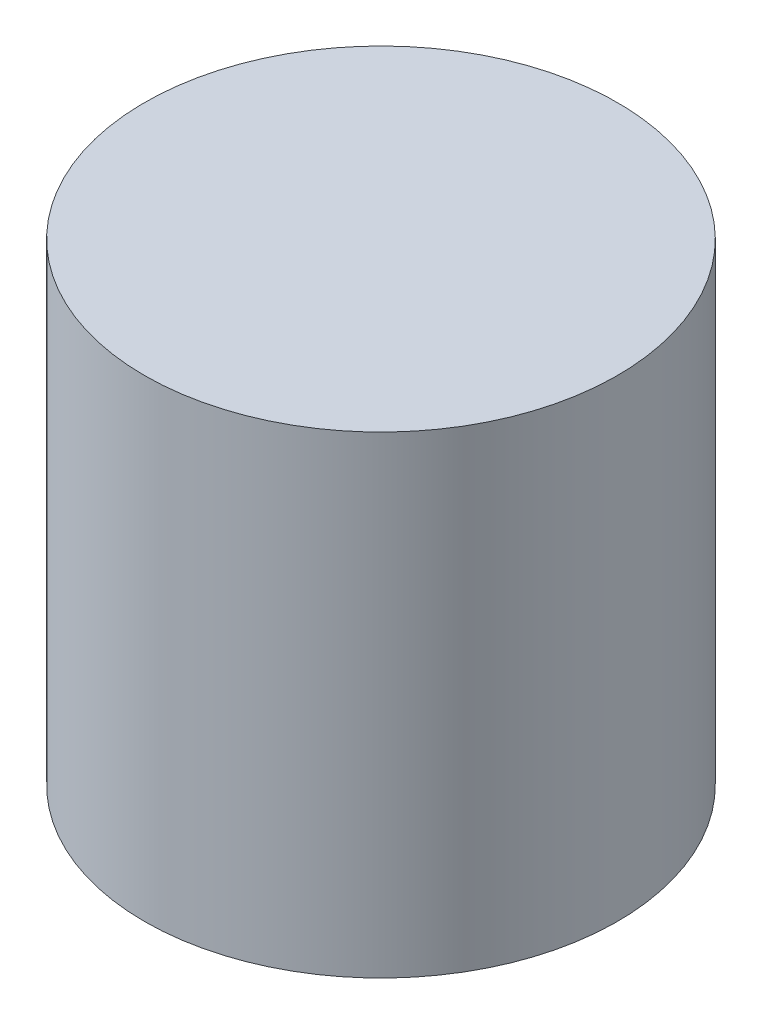
ISO-10303-21;
HEADER;
FILE_DESCRIPTION(('STEP AP214'),'2;1');
FILE_NAME('part.step','',(''),(''),'','','');
FILE_SCHEMA(('AUTOMOTIVE_DESIGN { 1 0 10303 214 1 1 1 1 }'));
ENDSEC;
DATA;
#1=APPLICATION_CONTEXT('core data for automotive mechanical design processes');
#2=APPLICATION_PROTOCOL_DEFINITION('international standard','automotive_design',2000,#1);
#3=PRODUCT_CONTEXT('',#1,'mechanical');
#4=PRODUCT('Part','Part','',(#3));
#5=PRODUCT_RELATED_PRODUCT_CATEGORY('part','',(#4));
#6=PRODUCT_DEFINITION_FORMATION('','',#4);
#7=PRODUCT_DEFINITION_CONTEXT('part definition',#1,'design');
#8=PRODUCT_DEFINITION('design','',#6,#7);
#9=PRODUCT_DEFINITION_SHAPE('','',#8);
#10=(LENGTH_UNIT() NAMED_UNIT(*) SI_UNIT(.MILLI.,.METRE.));
#11=(NAMED_UNIT(*) PLANE_ANGLE_UNIT() SI_UNIT($,.RADIAN.));
#12=(NAMED_UNIT(*) SI_UNIT($,.STERADIAN.) SOLID_ANGLE_UNIT());
#13=UNCERTAINTY_MEASURE_WITH_UNIT(LENGTH_MEASURE(1.E-05),#10,'distance_accuracy_value','');
#14=(GEOMETRIC_REPRESENTATION_CONTEXT(3) GLOBAL_UNCERTAINTY_ASSIGNED_CONTEXT((#13)) GLOBAL_UNIT_ASSIGNED_CONTEXT((#10,
#11,#12)) REPRESENTATION_CONTEXT('',''));
#15=CARTESIAN_POINT('',(0.,0.,0.));
#16=DIRECTION('',(0.,0.,1.));
#17=DIRECTION('',(1.,0.,0.));
#18=AXIS2_PLACEMENT_3D('',#15,#16,#17);
#19=CARTESIAN_POINT('',(0.,3.,0.));
#20=DIRECTION('',(0.,-1.,0.));
#21=DIRECTION('',(0.,0.,-1.));
#22=AXIS2_PLACEMENT_3D('',#19,#20,#21);
#23=CYLINDRICAL_SURFACE('',#22,1.50000000000001);
#24=CARTESIAN_POINT('',(0.,3.,0.));
#25=DIRECTION('',(0.,1.,0.));
#26=DIRECTION('',(0.,0.,1.));
#27=AXIS2_PLACEMENT_3D('',#24,#25,#26);
#28=CIRCLE('',#27,1.50000000000001);
#29=CARTESIAN_POINT('',(0.,3.,1.50000000000001));
#30=VERTEX_POINT('',#29);
#31=EDGE_CURVE('E10',#30,#30,#28,.T.);
#32=ORIENTED_EDGE('',*,*,#31,.F.);
#33=EDGE_LOOP('',(#32));
#34=FACE_BOUND('',#33,.T.);
#35=CARTESIAN_POINT('',(0.,0.,0.));
#36=DIRECTION('',(0.,1.,0.));
#37=DIRECTION('',(0.,0.,1.));
#38=AXIS2_PLACEMENT_3D('',#35,#36,#37);
#39=CIRCLE('',#38,1.50000000000001);
#40=CARTESIAN_POINT('',(0.,0.,1.50000000000001));
#41=VERTEX_POINT('',#40);
#42=EDGE_CURVE('E34',#41,#41,#39,.T.);
#43=ORIENTED_EDGE('',*,*,#42,.T.);
#44=EDGE_LOOP('',(#43));
#45=FACE_BOUND('',#44,.T.);
#46=ADVANCED_FACE('F31',(#34,#45),#23,.T.);
#47=CARTESIAN_POINT('',(0.,3.,0.));
#48=DIRECTION('',(0.,1.,0.));
#49=DIRECTION('',(0.,0.,1.));
#50=AXIS2_PLACEMENT_3D('',#47,#48,#49);
#51=PLANE('',#50);
#52=ORIENTED_EDGE('',*,*,#31,.T.);
#53=EDGE_LOOP('',(#52));
#54=FACE_BOUND('',#53,.T.);
#55=ADVANCED_FACE('F46',(#54),#51,.T.);
#56=CARTESIAN_POINT('',(0.,0.,0.));
#57=DIRECTION('',(0.,1.,0.));
#58=DIRECTION('',(0.,0.,1.));
#59=AXIS2_PLACEMENT_3D('',#56,#57,#58);
#60=PLANE('',#59);
#61=ORIENTED_EDGE('',*,*,#42,.F.);
#62=EDGE_LOOP('',(#61));
#63=FACE_BOUND('',#62,.T.);
#64=ADVANCED_FACE('F44',(#63),#60,.F.);
#65=CLOSED_SHELL('',(#46,#55,#64));
#66=MANIFOLD_SOLID_BREP('B2',#65);
#67=ADVANCED_BREP_SHAPE_REPRESENTATION('',(#18,#66),#14);
#68=SHAPE_DEFINITION_REPRESENTATION(#9,#67);
ENDSEC;
END-ISO-10303-21;
